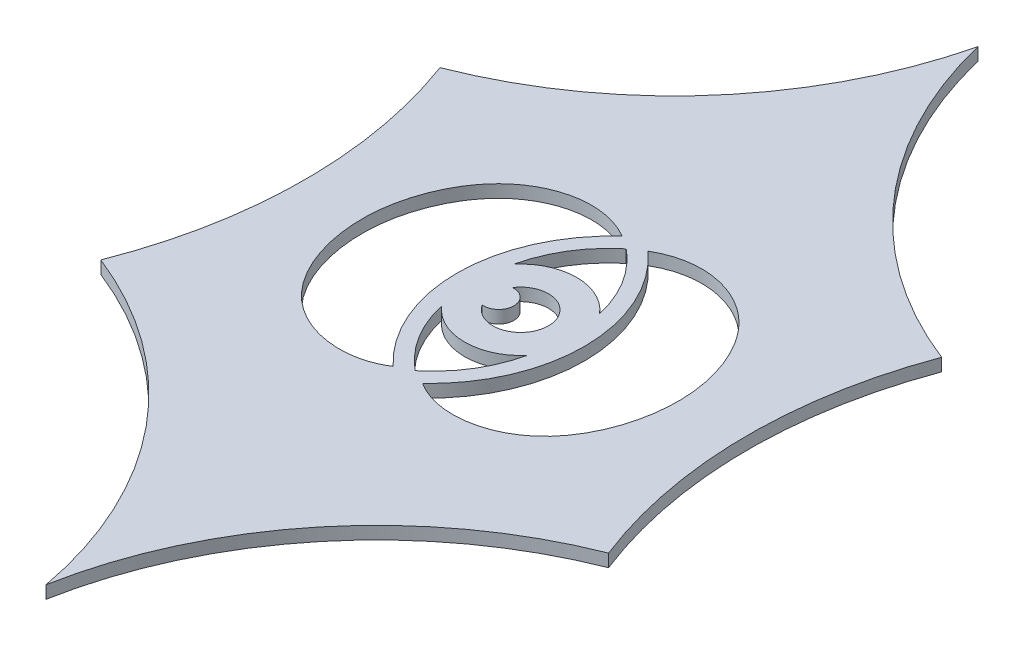
ISO-10303-21;
HEADER;
FILE_DESCRIPTION(('STEP AP214'),'2;1');
FILE_NAME('part.step','',(''),(''),'','','');
FILE_SCHEMA(('AUTOMOTIVE_DESIGN { 1 0 10303 214 1 1 1 1 }'));
ENDSEC;
DATA;
#1=APPLICATION_CONTEXT('core data for automotive mechanical design processes');
#2=APPLICATION_PROTOCOL_DEFINITION('international standard','automotive_design',2000,#1);
#3=PRODUCT_CONTEXT('',#1,'mechanical');
#4=PRODUCT('Part','Part','',(#3));
#5=PRODUCT_RELATED_PRODUCT_CATEGORY('part','',(#4));
#6=PRODUCT_DEFINITION_FORMATION('','',#4);
#7=PRODUCT_DEFINITION_CONTEXT('part definition',#1,'design');
#8=PRODUCT_DEFINITION('design','',#6,#7);
#9=PRODUCT_DEFINITION_SHAPE('','',#8);
#10=(LENGTH_UNIT() NAMED_UNIT(*) SI_UNIT(.MILLI.,.METRE.));
#11=(NAMED_UNIT(*) PLANE_ANGLE_UNIT() SI_UNIT($,.RADIAN.));
#12=(NAMED_UNIT(*) SI_UNIT($,.STERADIAN.) SOLID_ANGLE_UNIT());
#13=UNCERTAINTY_MEASURE_WITH_UNIT(LENGTH_MEASURE(1.E-05),#10,'distance_accuracy_value','');
#14=(GEOMETRIC_REPRESENTATION_CONTEXT(3) GLOBAL_UNCERTAINTY_ASSIGNED_CONTEXT((#13)) GLOBAL_UNIT_ASSIGNED_CONTEXT((#10,
#11,#12)) REPRESENTATION_CONTEXT('',''));
#15=CARTESIAN_POINT('',(0.,0.,0.));
#16=DIRECTION('',(0.,0.,1.));
#17=DIRECTION('',(1.,0.,0.));
#18=AXIS2_PLACEMENT_3D('',#15,#16,#17);
#19=CARTESIAN_POINT('',(-81.2013157253591,2.,55.9557471581085));
#20=DIRECTION('',(0.,-1.,0.));
#21=DIRECTION('',(0.,0.,-1.));
#22=AXIS2_PLACEMENT_3D('',#19,#20,#21);
#23=PLANE('',#22);
#24=CARTESIAN_POINT('',(1.40850626501724,2.,100.007354542178));
#25=DIRECTION('',(0.,1.,0.));
#26=DIRECTION('',(0.,0.,1.));
#27=AXIS2_PLACEMENT_3D('',#24,#25,#26);
#28=CIRCLE('',#27,2.39428416304299);
#29=CARTESIAN_POINT('',(1.19221139990784,2.,102.39184886692));
#30=VERTEX_POINT('',#29);
#31=CARTESIAN_POINT('',(1.19221139990784,2.,97.6228602174363));
#32=VERTEX_POINT('',#31);
#33=EDGE_CURVE('E535',#30,#32,#28,.T.);
#34=ORIENTED_EDGE('',*,*,#33,.T.);
#35=CARTESIAN_POINT('',(4.8757784966193,2.,100.007354542178));
#36=DIRECTION('',(0.,1.,0.));
#37=DIRECTION('',(0.,0.,1.));
#38=AXIS2_PLACEMENT_3D('',#35,#36,#37);
#39=CIRCLE('',#38,4.38799267783129);
#40=EDGE_CURVE('E598',#30,#32,#39,.T.);
#41=ORIENTED_EDGE('',*,*,#40,.F.);
#42=EDGE_LOOP('',(#34,#41));
#43=FACE_BOUND('',#42,.T.);
#44=CARTESIAN_POINT('',(-1.89476601173301,2.,94.3276147432732));
#45=CARTESIAN_POINT('',(-0.361746777607098,2.,87.7186330881803));
#46=CARTESIAN_POINT('',(4.8757784966193,2.,83.3684956212512));
#47=B_SPLINE_CURVE_WITH_KNOTS('',2,(#44,#45,#46),.UNSPECIFIED.,.F.,.F.,(3,3),(0.,1.),.UNSPECIFIED.);
#48=CARTESIAN_POINT('',(-1.894766011733,2.,94.3276147432732));
#49=VERTEX_POINT('',#48);
#50=CARTESIAN_POINT('',(4.8757784966193,2.,83.3684956212512));
#51=VERTEX_POINT('',#50);
#52=EDGE_CURVE('E388',#49,#51,#47,.T.);
#53=ORIENTED_EDGE('',*,*,#52,.T.);
#54=CARTESIAN_POINT('',(11.6463230049716,2.,94.3276147432732));
#55=CARTESIAN_POINT('',(10.1133037708457,2.,87.7186330881803));
#56=CARTESIAN_POINT('',(4.8757784966193,2.,83.3684956212512));
#57=B_SPLINE_CURVE_WITH_KNOTS('',2,(#54,#55,#56),.UNSPECIFIED.,.F.,.F.,(3,3),(0.,1.),.UNSPECIFIED.);
#58=CARTESIAN_POINT('',(11.6463230049716,2.,94.3276147432732));
#59=VERTEX_POINT('',#58);
#60=EDGE_CURVE('E399',#59,#51,#57,.T.);
#61=ORIENTED_EDGE('',*,*,#60,.F.);
#62=CARTESIAN_POINT('',(4.8757784966193,2.,100.007354542178));
#63=DIRECTION('',(0.,1.,0.));
#64=DIRECTION('',(0.,0.,1.));
#65=AXIS2_PLACEMENT_3D('',#62,#63,#64);
#66=CIRCLE('',#65,8.83740443359043);
#67=EDGE_CURVE('E548',#59,#49,#66,.T.);
#68=ORIENTED_EDGE('',*,*,#67,.T.);
#69=EDGE_LOOP('',(#53,#61,#68));
#70=FACE_BOUND('',#69,.T.);
#71=CARTESIAN_POINT('',(2.83477537223651,2.,81.9510319400845));
#72=CARTESIAN_POINT('',(-2.55605452272367,2.,78.7875266537394));
#73=CARTESIAN_POINT('',(-12.6377591844785,2.,80.7933104878205));
#74=CARTESIAN_POINT('',(-19.9798005375712,2.,92.8110770810218));
#75=CARTESIAN_POINT('',(-20.6831474284615,2.,105.116682284205));
#76=CARTESIAN_POINT('',(-15.8922541765127,2.,115.001664232109));
#77=CARTESIAN_POINT('',(-7.3399295592384,2.,120.227210357395));
#78=CARTESIAN_POINT('',(-0.894631463659453,2.,120.056173747916));
#79=CARTESIAN_POINT('',(2.54475910390169,2.,117.796144426813));
#80=B_SPLINE_CURVE_WITH_KNOTS('',3,(#71,#72,#73,#74,#75,#76,#77,#78,#79),.UNSPECIFIED.,.F.,.F.,
(4,1,1,1,1,1,4),(0.,0.238043411100059,0.386081266897119,0.575651621168982,0.751375083077591,
0.825495315764874,1.),.UNSPECIFIED.);
#81=CARTESIAN_POINT('',(2.83477537223651,2.,81.9510319400845));
#82=VERTEX_POINT('',#81);
#83=CARTESIAN_POINT('',(2.54475910390169,2.,117.796144426813));
#84=VERTEX_POINT('',#83);
#85=EDGE_CURVE('E435',#82,#84,#80,.T.);
#86=ORIENTED_EDGE('',*,*,#85,.F.);
#87=CARTESIAN_POINT('',(19.2228748569037,2.,100.007354542178));
#88=DIRECTION('',(0.,1.,0.));
#89=DIRECTION('',(0.,0.,1.));
#90=AXIS2_PLACEMENT_3D('',#87,#88,#89);
#91=CIRCLE('',#90,24.3844333670115);
#92=EDGE_CURVE('E430',#84,#82,#91,.F.);
#93=ORIENTED_EDGE('',*,*,#92,.F.);
#94=EDGE_LOOP('',(#86,#93));
#95=FACE_BOUND('',#94,.T.);
#96=CARTESIAN_POINT('',(-58.1830778029352,2.,12.7389817028704));
#97=DIRECTION('',(0.,-1.,0.));
#98=DIRECTION('',(0.,0.,-1.));
#99=AXIS2_PLACEMENT_3D('',#96,#97,#98);
#100=CIRCLE('',#99,65.);
#101=CARTESIAN_POINT('',(4.99999999896665,2.,28.000000000442));
#102=VERTEX_POINT('',#101);
#103=CARTESIAN_POINT('',(-34.5608225954712,2.,73.2946507926711));
#104=VERTEX_POINT('',#103);
#105=EDGE_CURVE('E449',#102,#104,#100,.T.);
#106=ORIENTED_EDGE('',*,*,#105,.T.);
#107=CARTESIAN_POINT('',(-104.219553647783,2.,99.1725126133465));
#108=DIRECTION('',(0.,-1.,0.));
#109=DIRECTION('',(0.,0.,-1.));
#110=AXIS2_PLACEMENT_3D('',#107,#108,#109);
#111=CIRCLE('',#110,74.3101779316149);
#112=CARTESIAN_POINT('',(-35.0422197546446,2.,126.311028041894));
#113=VERTEX_POINT('',#112);
#114=EDGE_CURVE('E452',#104,#113,#111,.T.);
#115=ORIENTED_EDGE('',*,*,#114,.T.);
#116=CARTESIAN_POINT('',(-58.9266258673452,2.,186.763779382454));
#117=DIRECTION('',(0.,-1.,0.));
#118=DIRECTION('',(0.,0.,-1.));
#119=AXIS2_PLACEMENT_3D('',#116,#117,#118);
#120=CIRCLE('',#119,65.);
#121=CARTESIAN_POINT('',(4.99999999896666,2.,175.000000000445));
#122=VERTEX_POINT('',#121);
#123=EDGE_CURVE('E455',#113,#122,#120,.T.);
#124=ORIENTED_EDGE('',*,*,#123,.T.);
#125=CARTESIAN_POINT('',(68.9266258652785,2.,186.763779382454));
#126=DIRECTION('',(0.,-1.,0.));
#127=DIRECTION('',(0.,0.,1.));
#128=AXIS2_PLACEMENT_3D('',#125,#126,#127);
#129=CIRCLE('',#128,65.);
#130=CARTESIAN_POINT('',(45.0422197525779,2.,126.311028041894));
#131=VERTEX_POINT('',#130);
#132=EDGE_CURVE('E457',#122,#131,#129,.T.);
#133=ORIENTED_EDGE('',*,*,#132,.T.);
#134=CARTESIAN_POINT('',(114.219553645716,2.,99.1725126133465));
#135=DIRECTION('',(0.,-1.,0.));
#136=DIRECTION('',(0.,0.,1.));
#137=AXIS2_PLACEMENT_3D('',#134,#135,#136);
#138=CIRCLE('',#137,74.310177931615);
#139=CARTESIAN_POINT('',(44.5608225934045,2.,73.2946507926711));
#140=VERTEX_POINT('',#139);
#141=EDGE_CURVE('E459',#131,#140,#138,.T.);
#142=ORIENTED_EDGE('',*,*,#141,.T.);
#143=CARTESIAN_POINT('',(68.1830778008685,2.,12.7389817028704));
#144=DIRECTION('',(0.,-1.,0.));
#145=DIRECTION('',(0.,0.,1.));
#146=AXIS2_PLACEMENT_3D('',#143,#144,#145);
#147=CIRCLE('',#146,65.);
#148=EDGE_CURVE('E461',#140,#102,#147,.T.);
#149=ORIENTED_EDGE('',*,*,#148,.T.);
#150=EDGE_LOOP('',(#106,#115,#124,#133,#142,#149));
#151=FACE_BOUND('',#150,.T.);
#152=CARTESIAN_POINT('',(11.6463230049716,2.,105.687094341083));
#153=CARTESIAN_POINT('',(10.1133037708457,2.,112.296075996176));
#154=CARTESIAN_POINT('',(4.8757784966193,2.,116.646213463105));
#155=B_SPLINE_CURVE_WITH_KNOTS('',2,(#152,#153,#154),.UNSPECIFIED.,.F.,.F.,(3,3),(0.,1.),.UNSPECIFIED.);
#156=CARTESIAN_POINT('',(11.6463230049716,2.,105.687094341083));
#157=VERTEX_POINT('',#156);
#158=CARTESIAN_POINT('',(4.8757784966193,2.,116.646213463105));
#159=VERTEX_POINT('',#158);
#160=EDGE_CURVE('E362',#157,#159,#155,.T.);
#161=ORIENTED_EDGE('',*,*,#160,.T.);
#162=CARTESIAN_POINT('',(-1.89476601173301,2.,105.687094341083));
#163=CARTESIAN_POINT('',(-0.361746777607097,2.,112.296075996176));
#164=CARTESIAN_POINT('',(4.8757784966193,2.,116.646213463105));
#165=B_SPLINE_CURVE_WITH_KNOTS('',2,(#162,#163,#164),.UNSPECIFIED.,.F.,.F.,(3,3),(0.,1.),.UNSPECIFIED.);
#166=CARTESIAN_POINT('',(-1.894766011733,2.,105.687094341083));
#167=VERTEX_POINT('',#166);
#168=EDGE_CURVE('E377',#167,#159,#165,.T.);
#169=ORIENTED_EDGE('',*,*,#168,.F.);
#170=CARTESIAN_POINT('',(4.8757784966193,2.,100.007354542178));
#171=DIRECTION('',(0.,1.,0.));
#172=DIRECTION('',(0.,0.,1.));
#173=AXIS2_PLACEMENT_3D('',#170,#171,#172);
#174=CIRCLE('',#173,8.83740443359043);
#175=EDGE_CURVE('E370',#167,#157,#174,.T.);
#176=ORIENTED_EDGE('',*,*,#175,.T.);
#177=EDGE_LOOP('',(#161,#169,#176));
#178=FACE_BOUND('',#177,.T.);
#179=CARTESIAN_POINT('',(6.91678162100209,2.,81.9510319400845));
#180=CARTESIAN_POINT('',(12.3076115159623,2.,78.7875266537395));
#181=CARTESIAN_POINT('',(22.3893161777171,2.,80.7933104878205));
#182=CARTESIAN_POINT('',(29.7313575308098,2.,92.8110770810218));
#183=CARTESIAN_POINT('',(30.4347044217001,2.,105.116682284205));
#184=CARTESIAN_POINT('',(25.6438111697513,2.,115.001664232109));
#185=CARTESIAN_POINT('',(17.091486552477,2.,120.227210357395));
#186=CARTESIAN_POINT('',(10.6461884568981,2.,120.056173747916));
#187=CARTESIAN_POINT('',(7.20679788933691,2.,117.796144426813));
#188=B_SPLINE_CURVE_WITH_KNOTS('',3,(#179,#180,#181,#182,#183,#184,#185,#186,#187),
.UNSPECIFIED.,.F.,.F.,(4,1,1,1,1,1,4),(0.,0.238043411100059,0.386081266897119,0.575651621168982,
0.751375083077591,0.825495315764874,1.),.UNSPECIFIED.);
#189=CARTESIAN_POINT('',(6.91678162100209,2.,81.9510319400845));
#190=VERTEX_POINT('',#189);
#191=CARTESIAN_POINT('',(7.20679788933691,2.,117.796144426813));
#192=VERTEX_POINT('',#191);
#193=EDGE_CURVE('E202',#190,#192,#188,.T.);
#194=ORIENTED_EDGE('',*,*,#193,.T.);
#195=CARTESIAN_POINT('',(-9.47131786366509,2.,100.007354542178));
#196=DIRECTION('',(0.,1.,0.));
#197=DIRECTION('',(0.,0.,1.));
#198=AXIS2_PLACEMENT_3D('',#195,#196,#197);
#199=CIRCLE('',#198,24.3844333670115);
#200=EDGE_CURVE('E322',#192,#190,#199,.T.);
#201=ORIENTED_EDGE('',*,*,#200,.T.);
#202=EDGE_LOOP('',(#194,#201));
#203=FACE_BOUND('',#202,.T.);
#204=ADVANCED_FACE('F187',(#43,#70,#95,#151,#178,#203),#23,.F.);
#205=CARTESIAN_POINT('',(-81.2013157253591,0.,55.9557471581085));
#206=DIRECTION('',(0.,-1.,0.));
#207=DIRECTION('',(0.,0.,-1.));
#208=AXIS2_PLACEMENT_3D('',#205,#206,#207);
#209=PLANE('',#208);
#210=CARTESIAN_POINT('',(4.8757784966193,0.,100.007354542178));
#211=DIRECTION('',(0.,1.,0.));
#212=DIRECTION('',(0.,0.,1.));
#213=AXIS2_PLACEMENT_3D('',#210,#211,#212);
#214=CIRCLE('',#213,4.38799267783129);
#215=CARTESIAN_POINT('',(1.19221139990784,0.,102.39184886692));
#216=VERTEX_POINT('',#215);
#217=CARTESIAN_POINT('',(1.19221139990784,0.,97.6228602174363));
#218=VERTEX_POINT('',#217);
#219=EDGE_CURVE('E596',#216,#218,#214,.T.);
#220=ORIENTED_EDGE('',*,*,#219,.T.);
#221=CARTESIAN_POINT('',(1.40850626501724,0.,100.007354542178));
#222=DIRECTION('',(0.,1.,0.));
#223=DIRECTION('',(0.,0.,1.));
#224=AXIS2_PLACEMENT_3D('',#221,#222,#223);
#225=CIRCLE('',#224,2.39428416304299);
#226=EDGE_CURVE('E601',#216,#218,#225,.T.);
#227=ORIENTED_EDGE('',*,*,#226,.F.);
#228=EDGE_LOOP('',(#220,#227));
#229=FACE_BOUND('',#228,.T.);
#230=CARTESIAN_POINT('',(11.6463230049716,0.,94.3276147432732));
#231=CARTESIAN_POINT('',(10.1133037708457,0.,87.7186330881803));
#232=CARTESIAN_POINT('',(4.8757784966193,0.,83.3684956212512));
#233=B_SPLINE_CURVE_WITH_KNOTS('',2,(#230,#231,#232),.UNSPECIFIED.,.F.,.F.,(3,3),(0.,1.),.UNSPECIFIED.);
#234=CARTESIAN_POINT('',(11.6463230049716,0.,94.3276147432732));
#235=VERTEX_POINT('',#234);
#236=CARTESIAN_POINT('',(4.8757784966193,0.,83.3684956212512));
#237=VERTEX_POINT('',#236);
#238=EDGE_CURVE('E555',#235,#237,#233,.T.);
#239=ORIENTED_EDGE('',*,*,#238,.T.);
#240=CARTESIAN_POINT('',(-1.89476601173301,0.,94.3276147432732));
#241=CARTESIAN_POINT('',(-0.361746777607098,0.,87.7186330881803));
#242=CARTESIAN_POINT('',(4.8757784966193,0.,83.3684956212512));
#243=B_SPLINE_CURVE_WITH_KNOTS('',2,(#240,#241,#242),.UNSPECIFIED.,.F.,.F.,(3,3),(0.,1.),.UNSPECIFIED.);
#244=CARTESIAN_POINT('',(-1.894766011733,0.,94.3276147432732));
#245=VERTEX_POINT('',#244);
#246=EDGE_CURVE('E393',#245,#237,#243,.T.);
#247=ORIENTED_EDGE('',*,*,#246,.F.);
#248=CARTESIAN_POINT('',(4.8757784966193,0.,100.007354542178));
#249=DIRECTION('',(0.,1.,0.));
#250=DIRECTION('',(0.,0.,1.));
#251=AXIS2_PLACEMENT_3D('',#248,#249,#250);
#252=CIRCLE('',#251,8.83740443359043);
#253=EDGE_CURVE('E398',#235,#245,#252,.T.);
#254=ORIENTED_EDGE('',*,*,#253,.F.);
#255=EDGE_LOOP('',(#239,#247,#254));
#256=FACE_BOUND('',#255,.T.);
#257=CARTESIAN_POINT('',(19.2228748569037,0.,100.007354542178));
#258=DIRECTION('',(0.,1.,0.));
#259=DIRECTION('',(0.,0.,1.));
#260=AXIS2_PLACEMENT_3D('',#257,#258,#259);
#261=CIRCLE('',#260,24.3844333670115);
#262=CARTESIAN_POINT('',(2.54475910390169,0.,117.796144426813));
#263=VERTEX_POINT('',#262);
#264=CARTESIAN_POINT('',(2.83477537223651,0.,81.9510319400845));
#265=VERTEX_POINT('',#264);
#266=EDGE_CURVE('E428',#263,#265,#261,.F.);
#267=ORIENTED_EDGE('',*,*,#266,.T.);
#268=CARTESIAN_POINT('',(2.83477537223651,0.,81.9510319400845));
#269=CARTESIAN_POINT('',(-2.55605452272367,0.,78.7875266537394));
#270=CARTESIAN_POINT('',(-12.6377591844785,0.,80.7933104878205));
#271=CARTESIAN_POINT('',(-19.9798005375712,0.,92.8110770810218));
#272=CARTESIAN_POINT('',(-20.6831474284615,0.,105.116682284205));
#273=CARTESIAN_POINT('',(-15.8922541765127,0.,115.001664232109));
#274=CARTESIAN_POINT('',(-7.3399295592384,0.,120.227210357395));
#275=CARTESIAN_POINT('',(-0.894631463659453,0.,120.056173747916));
#276=CARTESIAN_POINT('',(2.54475910390169,0.,117.796144426813));
#277=B_SPLINE_CURVE_WITH_KNOTS('',3,(#268,#269,#270,#271,#272,#273,#274,#275,#276),
.UNSPECIFIED.,.F.,.F.,(4,1,1,1,1,1,4),(0.,0.238043411100059,0.386081266897119,0.575651621168982,
0.751375083077591,0.825495315764874,1.),.UNSPECIFIED.);
#278=EDGE_CURVE('E420',#265,#263,#277,.T.);
#279=ORIENTED_EDGE('',*,*,#278,.T.);
#280=EDGE_LOOP('',(#267,#279));
#281=FACE_BOUND('',#280,.T.);
#282=CARTESIAN_POINT('',(-58.1830778029352,0.,12.7389817028704));
#283=DIRECTION('',(0.,-1.,0.));
#284=DIRECTION('',(0.,0.,-1.));
#285=AXIS2_PLACEMENT_3D('',#282,#283,#284);
#286=CIRCLE('',#285,65.);
#287=CARTESIAN_POINT('',(4.99999999896665,0.,28.000000000442));
#288=VERTEX_POINT('',#287);
#289=CARTESIAN_POINT('',(-34.5608225954712,0.,73.2946507926711));
#290=VERTEX_POINT('',#289);
#291=EDGE_CURVE('E446',#288,#290,#286,.T.);
#292=ORIENTED_EDGE('',*,*,#291,.F.);
#293=CARTESIAN_POINT('',(68.1830778008685,0.,12.7389817028704));
#294=DIRECTION('',(0.,-1.,0.));
#295=DIRECTION('',(0.,0.,1.));
#296=AXIS2_PLACEMENT_3D('',#293,#294,#295);
#297=CIRCLE('',#296,65.);
#298=CARTESIAN_POINT('',(44.5608225934045,0.,73.2946507926711));
#299=VERTEX_POINT('',#298);
#300=EDGE_CURVE('E453',#299,#288,#297,.T.);
#301=ORIENTED_EDGE('',*,*,#300,.F.);
#302=CARTESIAN_POINT('',(114.219553645716,0.,99.1725126133465));
#303=DIRECTION('',(0.,-1.,0.));
#304=DIRECTION('',(0.,0.,1.));
#305=AXIS2_PLACEMENT_3D('',#302,#303,#304);
#306=CIRCLE('',#305,74.310177931615);
#307=CARTESIAN_POINT('',(45.0422197525779,0.,126.311028041894));
#308=VERTEX_POINT('',#307);
#309=EDGE_CURVE('E472',#308,#299,#306,.T.);
#310=ORIENTED_EDGE('',*,*,#309,.F.);
#311=CARTESIAN_POINT('',(68.9266258652785,0.,186.763779382454));
#312=DIRECTION('',(0.,-1.,0.));
#313=DIRECTION('',(0.,0.,1.));
#314=AXIS2_PLACEMENT_3D('',#311,#312,#313);
#315=CIRCLE('',#314,65.);
#316=CARTESIAN_POINT('',(4.99999999896666,0.,175.000000000445));
#317=VERTEX_POINT('',#316);
#318=EDGE_CURVE('E470',#317,#308,#315,.T.);
#319=ORIENTED_EDGE('',*,*,#318,.F.);
#320=CARTESIAN_POINT('',(-58.9266258673452,0.,186.763779382454));
#321=DIRECTION('',(0.,-1.,0.));
#322=DIRECTION('',(0.,0.,-1.));
#323=AXIS2_PLACEMENT_3D('',#320,#321,#322);
#324=CIRCLE('',#323,65.);
#325=CARTESIAN_POINT('',(-35.0422197546446,0.,126.311028041894));
#326=VERTEX_POINT('',#325);
#327=EDGE_CURVE('E468',#326,#317,#324,.T.);
#328=ORIENTED_EDGE('',*,*,#327,.F.);
#329=CARTESIAN_POINT('',(-104.219553647783,0.,99.1725126133465));
#330=DIRECTION('',(0.,-1.,0.));
#331=DIRECTION('',(0.,0.,-1.));
#332=AXIS2_PLACEMENT_3D('',#329,#330,#331);
#333=CIRCLE('',#332,74.3101779316149);
#334=EDGE_CURVE('E466',#290,#326,#333,.T.);
#335=ORIENTED_EDGE('',*,*,#334,.F.);
#336=EDGE_LOOP('',(#292,#301,#310,#319,#328,#335));
#337=FACE_BOUND('',#336,.T.);
#338=CARTESIAN_POINT('',(-1.89476601173301,0.,105.687094341083));
#339=CARTESIAN_POINT('',(-0.361746777607097,0.,112.296075996176));
#340=CARTESIAN_POINT('',(4.8757784966193,0.,116.646213463105));
#341=B_SPLINE_CURVE_WITH_KNOTS('',2,(#338,#339,#340),.UNSPECIFIED.,.F.,.F.,(3,3),(0.,1.),.UNSPECIFIED.);
#342=CARTESIAN_POINT('',(-1.894766011733,0.,105.687094341083));
#343=VERTEX_POINT('',#342);
#344=CARTESIAN_POINT('',(4.8757784966193,0.,116.646213463105));
#345=VERTEX_POINT('',#344);
#346=EDGE_CURVE('E352',#343,#345,#341,.T.);
#347=ORIENTED_EDGE('',*,*,#346,.T.);
#348=CARTESIAN_POINT('',(11.6463230049716,0.,105.687094341083));
#349=CARTESIAN_POINT('',(10.1133037708457,0.,112.296075996176));
#350=CARTESIAN_POINT('',(4.8757784966193,0.,116.646213463105));
#351=B_SPLINE_CURVE_WITH_KNOTS('',2,(#348,#349,#350),.UNSPECIFIED.,.F.,.F.,(3,3),(0.,1.),.UNSPECIFIED.);
#352=CARTESIAN_POINT('',(11.6463230049716,0.,105.687094341083));
#353=VERTEX_POINT('',#352);
#354=EDGE_CURVE('E382',#353,#345,#351,.T.);
#355=ORIENTED_EDGE('',*,*,#354,.F.);
#356=CARTESIAN_POINT('',(4.8757784966193,0.,100.007354542178));
#357=DIRECTION('',(0.,1.,0.));
#358=DIRECTION('',(0.,0.,1.));
#359=AXIS2_PLACEMENT_3D('',#356,#357,#358);
#360=CIRCLE('',#359,8.83740443359043);
#361=EDGE_CURVE('E360',#343,#353,#360,.T.);
#362=ORIENTED_EDGE('',*,*,#361,.F.);
#363=EDGE_LOOP('',(#347,#355,#362));
#364=FACE_BOUND('',#363,.T.);
#365=CARTESIAN_POINT('',(-9.47131786366509,0.,100.007354542178));
#366=DIRECTION('',(0.,1.,0.));
#367=DIRECTION('',(0.,0.,1.));
#368=AXIS2_PLACEMENT_3D('',#365,#366,#367);
#369=CIRCLE('',#368,24.3844333670115);
#370=CARTESIAN_POINT('',(7.20679788933691,0.,117.796144426813));
#371=VERTEX_POINT('',#370);
#372=CARTESIAN_POINT('',(6.91678162100209,0.,81.9510319400845));
#373=VERTEX_POINT('',#372);
#374=EDGE_CURVE('E311',#371,#373,#369,.T.);
#375=ORIENTED_EDGE('',*,*,#374,.F.);
#376=CARTESIAN_POINT('',(6.91678162100209,0.,81.9510319400845));
#377=CARTESIAN_POINT('',(12.3076115159623,0.,78.7875266537395));
#378=CARTESIAN_POINT('',(22.3893161777171,0.,80.7933104878205));
#379=CARTESIAN_POINT('',(29.7313575308098,0.,92.8110770810218));
#380=CARTESIAN_POINT('',(30.4347044217001,0.,105.116682284205));
#381=CARTESIAN_POINT('',(25.6438111697513,0.,115.001664232109));
#382=CARTESIAN_POINT('',(17.091486552477,0.,120.227210357395));
#383=CARTESIAN_POINT('',(10.6461884568981,0.,120.056173747916));
#384=CARTESIAN_POINT('',(7.20679788933691,0.,117.796144426813));
#385=B_SPLINE_CURVE_WITH_KNOTS('',3,(#376,#377,#378,#379,#380,#381,#382,#383,#384),
.UNSPECIFIED.,.F.,.F.,(4,1,1,1,1,1,4),(0.,0.238043411100059,0.386081266897119,0.575651621168982,
0.751375083077591,0.825495315764874,1.),.UNSPECIFIED.);
#386=EDGE_CURVE('E317',#373,#371,#385,.T.);
#387=ORIENTED_EDGE('',*,*,#386,.F.);
#388=EDGE_LOOP('',(#375,#387));
#389=FACE_BOUND('',#388,.T.);
#390=ADVANCED_FACE('F321',(#229,#256,#281,#337,#364,#389),#209,.T.);
#391=CARTESIAN_POINT('',(-58.1830778029352,2.,12.7389817028704));
#392=DIRECTION('',(0.,-1.,0.));
#393=DIRECTION('',(0.,0.,-1.));
#394=AXIS2_PLACEMENT_3D('',#391,#392,#393);
#395=CYLINDRICAL_SURFACE('',#394,65.);
#396=ORIENTED_EDGE('',*,*,#291,.T.);
#397=DIRECTION('',(0.,-1.,0.));
#398=VECTOR('',#397,1.);
#399=CARTESIAN_POINT('',(-34.5608225954712,2.,73.2946507926711));
#400=LINE('',#399,#398);
#401=EDGE_CURVE('E12',#104,#290,#400,.T.);
#402=ORIENTED_EDGE('',*,*,#401,.F.);
#403=ORIENTED_EDGE('',*,*,#105,.F.);
#404=DIRECTION('',(0.,-1.,0.));
#405=VECTOR('',#404,1.);
#406=CARTESIAN_POINT('',(4.99999999896665,2.,28.000000000442));
#407=LINE('',#406,#405);
#408=EDGE_CURVE('E463',#102,#288,#407,.T.);
#409=ORIENTED_EDGE('',*,*,#408,.T.);
#410=EDGE_LOOP('',(#396,#402,#403,#409));
#411=FACE_BOUND('',#410,.T.);
#412=ADVANCED_FACE('F189',(#411),#395,.F.);
#413=CARTESIAN_POINT('',(-104.219553647783,2.,99.1725126133465));
#414=DIRECTION('',(0.,-1.,0.));
#415=DIRECTION('',(0.,0.,-1.));
#416=AXIS2_PLACEMENT_3D('',#413,#414,#415);
#417=CYLINDRICAL_SURFACE('',#416,74.3101779316149);
#418=ORIENTED_EDGE('',*,*,#334,.T.);
#419=DIRECTION('',(0.,-1.,0.));
#420=VECTOR('',#419,1.);
#421=CARTESIAN_POINT('',(-35.0422197546446,2.,126.311028041894));
#422=LINE('',#421,#420);
#423=EDGE_CURVE('E195',#113,#326,#422,.T.);
#424=ORIENTED_EDGE('',*,*,#423,.F.);
#425=ORIENTED_EDGE('',*,*,#114,.F.);
#426=ORIENTED_EDGE('',*,*,#401,.T.);
#427=EDGE_LOOP('',(#418,#424,#425,#426));
#428=FACE_BOUND('',#427,.T.);
#429=ADVANCED_FACE('F513',(#428),#417,.F.);
#430=CARTESIAN_POINT('',(-58.9266258673452,2.,186.763779382454));
#431=DIRECTION('',(0.,-1.,0.));
#432=DIRECTION('',(0.,0.,-1.));
#433=AXIS2_PLACEMENT_3D('',#430,#431,#432);
#434=CYLINDRICAL_SURFACE('',#433,65.);
#435=ORIENTED_EDGE('',*,*,#327,.T.);
#436=DIRECTION('',(0.,-1.,0.));
#437=VECTOR('',#436,1.);
#438=CARTESIAN_POINT('',(4.99999999896666,2.,175.000000000445));
#439=LINE('',#438,#437);
#440=EDGE_CURVE('E483',#122,#317,#439,.T.);
#441=ORIENTED_EDGE('',*,*,#440,.F.);
#442=ORIENTED_EDGE('',*,*,#123,.F.);
#443=ORIENTED_EDGE('',*,*,#423,.T.);
#444=EDGE_LOOP('',(#435,#441,#442,#443));
#445=FACE_BOUND('',#444,.T.);
#446=ADVANCED_FACE('F490',(#445),#434,.F.);
#447=CARTESIAN_POINT('',(68.9266258652785,2.,186.763779382454));
#448=DIRECTION('',(0.,-1.,0.));
#449=DIRECTION('',(0.,0.,-1.));
#450=AXIS2_PLACEMENT_3D('',#447,#448,#449);
#451=CYLINDRICAL_SURFACE('',#450,65.);
#452=ORIENTED_EDGE('',*,*,#318,.T.);
#453=DIRECTION('',(0.,-1.,0.));
#454=VECTOR('',#453,1.);
#455=CARTESIAN_POINT('',(45.0422197525779,2.,126.311028041894));
#456=LINE('',#455,#454);
#457=EDGE_CURVE('E480',#131,#308,#456,.T.);
#458=ORIENTED_EDGE('',*,*,#457,.F.);
#459=ORIENTED_EDGE('',*,*,#132,.F.);
#460=ORIENTED_EDGE('',*,*,#440,.T.);
#461=EDGE_LOOP('',(#452,#458,#459,#460));
#462=FACE_BOUND('',#461,.T.);
#463=ADVANCED_FACE('F501',(#462),#451,.F.);
#464=CARTESIAN_POINT('',(114.219553645716,2.,99.1725126133465));
#465=DIRECTION('',(0.,-1.,0.));
#466=DIRECTION('',(0.,0.,-1.));
#467=AXIS2_PLACEMENT_3D('',#464,#465,#466);
#468=CYLINDRICAL_SURFACE('',#467,74.310177931615);
#469=ORIENTED_EDGE('',*,*,#309,.T.);
#470=DIRECTION('',(0.,-1.,0.));
#471=VECTOR('',#470,1.);
#472=CARTESIAN_POINT('',(44.5608225934045,2.,73.2946507926711));
#473=LINE('',#472,#471);
#474=EDGE_CURVE('E477',#140,#299,#473,.T.);
#475=ORIENTED_EDGE('',*,*,#474,.F.);
#476=ORIENTED_EDGE('',*,*,#141,.F.);
#477=ORIENTED_EDGE('',*,*,#457,.T.);
#478=EDGE_LOOP('',(#469,#475,#476,#477));
#479=FACE_BOUND('',#478,.T.);
#480=ADVANCED_FACE('F505',(#479),#468,.F.);
#481=CARTESIAN_POINT('',(68.1830778008685,2.,12.7389817028704));
#482=DIRECTION('',(0.,-1.,0.));
#483=DIRECTION('',(0.,0.,-1.));
#484=AXIS2_PLACEMENT_3D('',#481,#482,#483);
#485=CYLINDRICAL_SURFACE('',#484,65.);
#486=ORIENTED_EDGE('',*,*,#300,.T.);
#487=ORIENTED_EDGE('',*,*,#408,.F.);
#488=ORIENTED_EDGE('',*,*,#148,.F.);
#489=ORIENTED_EDGE('',*,*,#474,.T.);
#490=EDGE_LOOP('',(#486,#487,#488,#489));
#491=FACE_BOUND('',#490,.T.);
#492=ADVANCED_FACE('F516',(#491),#485,.F.);
#493=CARTESIAN_POINT('',(19.2228748569037,0.,100.007354542178));
#494=DIRECTION('',(0.,1.,0.));
#495=DIRECTION('',(0.,0.,1.));
#496=AXIS2_PLACEMENT_3D('',#493,#494,#495);
#497=CYLINDRICAL_SURFACE('',#496,24.3844333670115);
#498=ORIENTED_EDGE('',*,*,#92,.T.);
#499=DIRECTION('',(0.,1.,0.));
#500=VECTOR('',#499,1.);
#501=CARTESIAN_POINT('',(2.83477537223651,0.,81.9510319400845));
#502=LINE('',#501,#500);
#503=EDGE_CURVE('E427',#265,#82,#502,.T.);
#504=ORIENTED_EDGE('',*,*,#503,.F.);
#505=ORIENTED_EDGE('',*,*,#266,.F.);
#506=DIRECTION('',(0.,1.,0.));
#507=VECTOR('',#506,1.);
#508=CARTESIAN_POINT('',(2.54475910390169,0.,117.796144426813));
#509=LINE('',#508,#507);
#510=EDGE_CURVE('E441',#263,#84,#509,.T.);
#511=ORIENTED_EDGE('',*,*,#510,.T.);
#512=EDGE_LOOP('',(#498,#504,#505,#511));
#513=FACE_BOUND('',#512,.T.);
#514=ADVANCED_FACE('F417',(#513),#497,.T.);
#515=DIRECTION('',(0.,1.,0.));
#516=VECTOR('',#515,1.);
#517=SURFACE_OF_LINEAR_EXTRUSION('',#277,#516);
#518=ORIENTED_EDGE('',*,*,#85,.T.);
#519=ORIENTED_EDGE('',*,*,#510,.F.);
#520=ORIENTED_EDGE('',*,*,#278,.F.);
#521=ORIENTED_EDGE('',*,*,#503,.T.);
#522=EDGE_LOOP('',(#518,#519,#520,#521));
#523=FACE_BOUND('',#522,.T.);
#524=ADVANCED_FACE('F410',(#523),#517,.F.);
#525=DIRECTION('',(0.,1.,0.));
#526=VECTOR('',#525,1.);
#527=SURFACE_OF_LINEAR_EXTRUSION('',#243,#526);
#528=ORIENTED_EDGE('',*,*,#52,.F.);
#529=DIRECTION('',(0.,1.,0.));
#530=VECTOR('',#529,1.);
#531=CARTESIAN_POINT('',(-1.894766011733,0.,94.3276147432732));
#532=LINE('',#531,#530);
#533=EDGE_CURVE('E571',#245,#49,#532,.T.);
#534=ORIENTED_EDGE('',*,*,#533,.F.);
#535=ORIENTED_EDGE('',*,*,#246,.T.);
#536=DIRECTION('',(0.,1.,0.));
#537=VECTOR('',#536,1.);
#538=CARTESIAN_POINT('',(4.8757784966193,0.,83.3684956212512));
#539=LINE('',#538,#537);
#540=EDGE_CURVE('E436',#237,#51,#539,.T.);
#541=ORIENTED_EDGE('',*,*,#540,.T.);
#542=EDGE_LOOP('',(#528,#534,#535,#541));
#543=FACE_BOUND('',#542,.T.);
#544=ADVANCED_FACE('F405',(#543),#527,.T.);
#545=DIRECTION('',(0.,1.,0.));
#546=VECTOR('',#545,1.);
#547=SURFACE_OF_LINEAR_EXTRUSION('',#233,#546);
#548=ORIENTED_EDGE('',*,*,#60,.T.);
#549=ORIENTED_EDGE('',*,*,#540,.F.);
#550=ORIENTED_EDGE('',*,*,#238,.F.);
#551=DIRECTION('',(0.,1.,0.));
#552=VECTOR('',#551,1.);
#553=CARTESIAN_POINT('',(11.6463230049716,0.,94.3276147432732));
#554=LINE('',#553,#552);
#555=EDGE_CURVE('E570',#235,#59,#554,.T.);
#556=ORIENTED_EDGE('',*,*,#555,.T.);
#557=EDGE_LOOP('',(#548,#549,#550,#556));
#558=FACE_BOUND('',#557,.T.);
#559=ADVANCED_FACE('F409',(#558),#547,.F.);
#560=CARTESIAN_POINT('',(4.8757784966193,0.,100.007354542178));
#561=DIRECTION('',(0.,1.,0.));
#562=DIRECTION('',(0.,0.,1.));
#563=AXIS2_PLACEMENT_3D('',#560,#561,#562);
#564=CYLINDRICAL_SURFACE('',#563,8.83740443359043);
#565=ORIENTED_EDGE('',*,*,#67,.F.);
#566=ORIENTED_EDGE('',*,*,#555,.F.);
#567=ORIENTED_EDGE('',*,*,#253,.T.);
#568=ORIENTED_EDGE('',*,*,#533,.T.);
#569=EDGE_LOOP('',(#565,#566,#567,#568));
#570=FACE_BOUND('',#569,.T.);
#571=ADVANCED_FACE('F412',(#570),#564,.T.);
#572=DIRECTION('',(0.,1.,0.));
#573=VECTOR('',#572,1.);
#574=SURFACE_OF_LINEAR_EXTRUSION('',#351,#573);
#575=ORIENTED_EDGE('',*,*,#160,.F.);
#576=DIRECTION('',(0.,1.,0.));
#577=VECTOR('',#576,1.);
#578=CARTESIAN_POINT('',(11.6463230049716,0.,105.687094341083));
#579=LINE('',#578,#577);
#580=EDGE_CURVE('E359',#353,#157,#579,.T.);
#581=ORIENTED_EDGE('',*,*,#580,.F.);
#582=ORIENTED_EDGE('',*,*,#354,.T.);
#583=DIRECTION('',(0.,1.,0.));
#584=VECTOR('',#583,1.);
#585=CARTESIAN_POINT('',(4.8757784966193,0.,116.646213463105));
#586=LINE('',#585,#584);
#587=EDGE_CURVE('E383',#345,#159,#586,.T.);
#588=ORIENTED_EDGE('',*,*,#587,.T.);
#589=EDGE_LOOP('',(#575,#581,#582,#588));
#590=FACE_BOUND('',#589,.T.);
#591=ADVANCED_FACE('F349',(#590),#574,.T.);
#592=DIRECTION('',(0.,1.,0.));
#593=VECTOR('',#592,1.);
#594=SURFACE_OF_LINEAR_EXTRUSION('',#341,#593);
#595=ORIENTED_EDGE('',*,*,#168,.T.);
#596=ORIENTED_EDGE('',*,*,#587,.F.);
#597=ORIENTED_EDGE('',*,*,#346,.F.);
#598=DIRECTION('',(0.,1.,0.));
#599=VECTOR('',#598,1.);
#600=CARTESIAN_POINT('',(-1.894766011733,0.,105.687094341083));
#601=LINE('',#600,#599);
#602=EDGE_CURVE('E389',#343,#167,#601,.T.);
#603=ORIENTED_EDGE('',*,*,#602,.T.);
#604=EDGE_LOOP('',(#595,#596,#597,#603));
#605=FACE_BOUND('',#604,.T.);
#606=ADVANCED_FACE('F345',(#605),#594,.F.);
#607=CARTESIAN_POINT('',(4.8757784966193,0.,100.007354542178));
#608=DIRECTION('',(0.,1.,0.));
#609=DIRECTION('',(0.,0.,1.));
#610=AXIS2_PLACEMENT_3D('',#607,#608,#609);
#611=CYLINDRICAL_SURFACE('',#610,8.83740443359043);
#612=ORIENTED_EDGE('',*,*,#175,.F.);
#613=ORIENTED_EDGE('',*,*,#602,.F.);
#614=ORIENTED_EDGE('',*,*,#361,.T.);
#615=ORIENTED_EDGE('',*,*,#580,.T.);
#616=EDGE_LOOP('',(#612,#613,#614,#615));
#617=FACE_BOUND('',#616,.T.);
#618=ADVANCED_FACE('F343',(#617),#611,.T.);
#619=CARTESIAN_POINT('',(1.40850626501724,0.,100.007354542178));
#620=DIRECTION('',(0.,1.,0.));
#621=DIRECTION('',(0.,0.,1.));
#622=AXIS2_PLACEMENT_3D('',#619,#620,#621);
#623=CYLINDRICAL_SURFACE('',#622,2.39428416304299);
#624=ORIENTED_EDGE('',*,*,#33,.F.);
#625=DIRECTION('',(0.,1.,0.));
#626=VECTOR('',#625,1.);
#627=CARTESIAN_POINT('',(1.19221139990784,0.,102.39184886692));
#628=LINE('',#627,#626);
#629=EDGE_CURVE('E590',#216,#30,#628,.T.);
#630=ORIENTED_EDGE('',*,*,#629,.F.);
#631=ORIENTED_EDGE('',*,*,#226,.T.);
#632=DIRECTION('',(0.,1.,0.));
#633=VECTOR('',#632,1.);
#634=CARTESIAN_POINT('',(1.19221139990784,0.,97.6228602174363));
#635=LINE('',#634,#633);
#636=EDGE_CURVE('E371',#218,#32,#635,.T.);
#637=ORIENTED_EDGE('',*,*,#636,.T.);
#638=EDGE_LOOP('',(#624,#630,#631,#637));
#639=FACE_BOUND('',#638,.T.);
#640=ADVANCED_FACE('F339',(#639),#623,.T.);
#641=CARTESIAN_POINT('',(4.8757784966193,0.,100.007354542178));
#642=DIRECTION('',(0.,1.,0.));
#643=DIRECTION('',(0.,0.,1.));
#644=AXIS2_PLACEMENT_3D('',#641,#642,#643);
#645=CYLINDRICAL_SURFACE('',#644,4.38799267783129);
#646=ORIENTED_EDGE('',*,*,#40,.T.);
#647=ORIENTED_EDGE('',*,*,#636,.F.);
#648=ORIENTED_EDGE('',*,*,#219,.F.);
#649=ORIENTED_EDGE('',*,*,#629,.T.);
#650=EDGE_LOOP('',(#646,#647,#648,#649));
#651=FACE_BOUND('',#650,.T.);
#652=ADVANCED_FACE('F336',(#651),#645,.F.);
#653=DIRECTION('',(0.,1.,0.));
#654=VECTOR('',#653,1.);
#655=SURFACE_OF_LINEAR_EXTRUSION('',#385,#654);
#656=ORIENTED_EDGE('',*,*,#193,.F.);
#657=DIRECTION('',(0.,1.,0.));
#658=VECTOR('',#657,1.);
#659=CARTESIAN_POINT('',(6.91678162100209,0.,81.9510319400845));
#660=LINE('',#659,#658);
#661=EDGE_CURVE('E313',#373,#190,#660,.T.);
#662=ORIENTED_EDGE('',*,*,#661,.F.);
#663=ORIENTED_EDGE('',*,*,#386,.T.);
#664=DIRECTION('',(0.,1.,0.));
#665=VECTOR('',#664,1.);
#666=CARTESIAN_POINT('',(7.20679788933691,0.,117.796144426813));
#667=LINE('',#666,#665);
#668=EDGE_CURVE('E209',#371,#192,#667,.T.);
#669=ORIENTED_EDGE('',*,*,#668,.T.);
#670=EDGE_LOOP('',(#656,#662,#663,#669));
#671=FACE_BOUND('',#670,.T.);
#672=ADVANCED_FACE('F319',(#671),#655,.T.);
#673=CARTESIAN_POINT('',(-9.47131786366509,0.,100.007354542178));
#674=DIRECTION('',(0.,1.,0.));
#675=DIRECTION('',(0.,0.,1.));
#676=AXIS2_PLACEMENT_3D('',#673,#674,#675);
#677=CYLINDRICAL_SURFACE('',#676,24.3844333670115);
#678=ORIENTED_EDGE('',*,*,#200,.F.);
#679=ORIENTED_EDGE('',*,*,#668,.F.);
#680=ORIENTED_EDGE('',*,*,#374,.T.);
#681=ORIENTED_EDGE('',*,*,#661,.T.);
#682=EDGE_LOOP('',(#678,#679,#680,#681));
#683=FACE_BOUND('',#682,.T.);
#684=ADVANCED_FACE('F312',(#683),#677,.T.);
#685=CLOSED_SHELL('',(#204,#390,#412,#429,#446,#463,#480,#492,#514,#524,#544,#559,#571,#591,
#606,#618,#640,#652,#672,#684));
#686=MANIFOLD_SOLID_BREP('B2',#685);
#687=ADVANCED_BREP_SHAPE_REPRESENTATION('',(#18,#686),#14);
#688=SHAPE_DEFINITION_REPRESENTATION(#9,#687);
ENDSEC;
END-ISO-10303-21;
